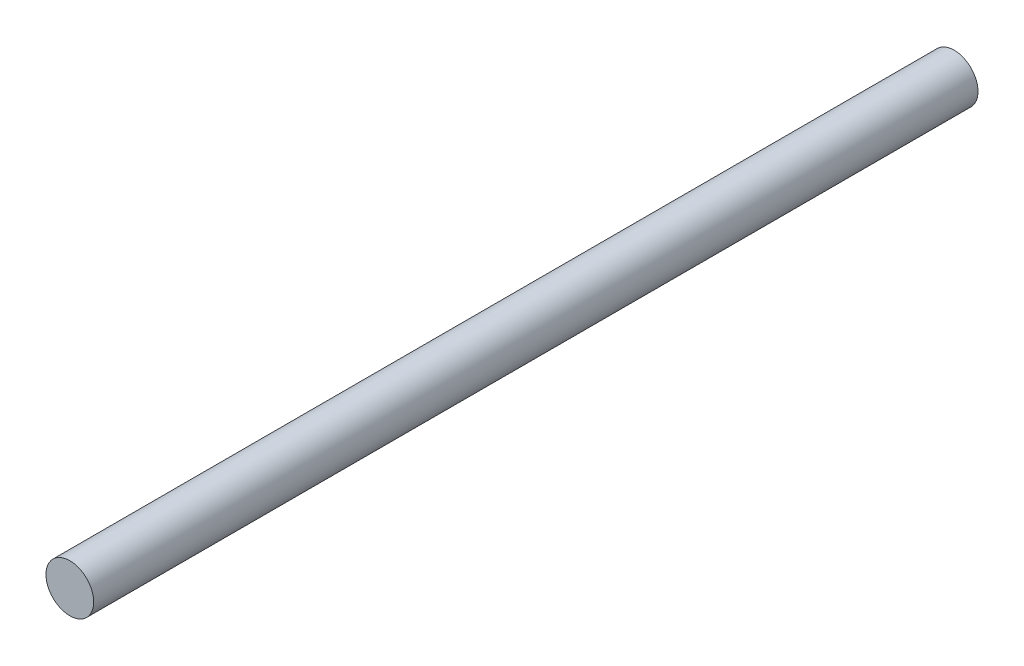
ISO-10303-21;
HEADER;
FILE_DESCRIPTION(('STEP AP214'),'2;1');
FILE_NAME('part.step','',(''),(''),'','','');
FILE_SCHEMA(('AUTOMOTIVE_DESIGN { 1 0 10303 214 1 1 1 1 }'));
ENDSEC;
DATA;
#1=APPLICATION_CONTEXT('core data for automotive mechanical design processes');
#2=APPLICATION_PROTOCOL_DEFINITION('international standard','automotive_design',2000,#1);
#3=PRODUCT_CONTEXT('',#1,'mechanical');
#4=PRODUCT('Part','Part','',(#3));
#5=PRODUCT_RELATED_PRODUCT_CATEGORY('part','',(#4));
#6=PRODUCT_DEFINITION_FORMATION('','',#4);
#7=PRODUCT_DEFINITION_CONTEXT('part definition',#1,'design');
#8=PRODUCT_DEFINITION('design','',#6,#7);
#9=PRODUCT_DEFINITION_SHAPE('','',#8);
#10=(LENGTH_UNIT() NAMED_UNIT(*) SI_UNIT(.MILLI.,.METRE.));
#11=(NAMED_UNIT(*) PLANE_ANGLE_UNIT() SI_UNIT($,.RADIAN.));
#12=(NAMED_UNIT(*) SI_UNIT($,.STERADIAN.) SOLID_ANGLE_UNIT());
#13=UNCERTAINTY_MEASURE_WITH_UNIT(LENGTH_MEASURE(1.E-05),#10,'distance_accuracy_value','');
#14=(GEOMETRIC_REPRESENTATION_CONTEXT(3) GLOBAL_UNCERTAINTY_ASSIGNED_CONTEXT((#13)) GLOBAL_UNIT_ASSIGNED_CONTEXT((#10,
#11,#12)) REPRESENTATION_CONTEXT('',''));
#15=CARTESIAN_POINT('',(0.,0.,0.));
#16=DIRECTION('',(0.,0.,1.));
#17=DIRECTION('',(1.,0.,0.));
#18=AXIS2_PLACEMENT_3D('',#15,#16,#17);
#19=CARTESIAN_POINT('',(0.,0.,350.));
#20=DIRECTION('',(0.,0.,-1.));
#21=DIRECTION('',(-1.,0.,0.));
#22=AXIS2_PLACEMENT_3D('',#19,#20,#21);
#23=CYLINDRICAL_SURFACE('',#22,9.4488);
#24=CARTESIAN_POINT('',(0.,0.,350.));
#25=DIRECTION('',(0.,0.,1.));
#26=DIRECTION('',(1.,0.,0.));
#27=AXIS2_PLACEMENT_3D('',#24,#25,#26);
#28=CIRCLE('',#27,9.4488);
#29=CARTESIAN_POINT('',(9.4488,0.,350.));
#30=VERTEX_POINT('',#29);
#31=EDGE_CURVE('E10',#30,#30,#28,.T.);
#32=ORIENTED_EDGE('',*,*,#31,.F.);
#33=EDGE_LOOP('',(#32));
#34=FACE_BOUND('',#33,.T.);
#35=CARTESIAN_POINT('',(0.,0.,0.));
#36=DIRECTION('',(0.,0.,1.));
#37=DIRECTION('',(1.,0.,0.));
#38=AXIS2_PLACEMENT_3D('',#35,#36,#37);
#39=CIRCLE('',#38,9.4488);
#40=CARTESIAN_POINT('',(9.4488,0.,0.));
#41=VERTEX_POINT('',#40);
#42=EDGE_CURVE('E34',#41,#41,#39,.T.);
#43=ORIENTED_EDGE('',*,*,#42,.T.);
#44=EDGE_LOOP('',(#43));
#45=FACE_BOUND('',#44,.T.);
#46=ADVANCED_FACE('F31',(#34,#45),#23,.T.);
#47=CARTESIAN_POINT('',(0.,0.,350.));
#48=DIRECTION('',(0.,0.,1.));
#49=DIRECTION('',(1.,0.,0.));
#50=AXIS2_PLACEMENT_3D('',#47,#48,#49);
#51=PLANE('',#50);
#52=ORIENTED_EDGE('',*,*,#31,.T.);
#53=EDGE_LOOP('',(#52));
#54=FACE_BOUND('',#53,.T.);
#55=ADVANCED_FACE('F46',(#54),#51,.T.);
#56=CARTESIAN_POINT('',(0.,0.,0.));
#57=DIRECTION('',(0.,0.,1.));
#58=DIRECTION('',(1.,0.,0.));
#59=AXIS2_PLACEMENT_3D('',#56,#57,#58);
#60=PLANE('',#59);
#61=ORIENTED_EDGE('',*,*,#42,.F.);
#62=EDGE_LOOP('',(#61));
#63=FACE_BOUND('',#62,.T.);
#64=ADVANCED_FACE('F44',(#63),#60,.F.);
#65=CLOSED_SHELL('',(#46,#55,#64));
#66=MANIFOLD_SOLID_BREP('B2',#65);
#67=ADVANCED_BREP_SHAPE_REPRESENTATION('',(#18,#66),#14);
#68=SHAPE_DEFINITION_REPRESENTATION(#9,#67);
ENDSEC;
END-ISO-10303-21;
